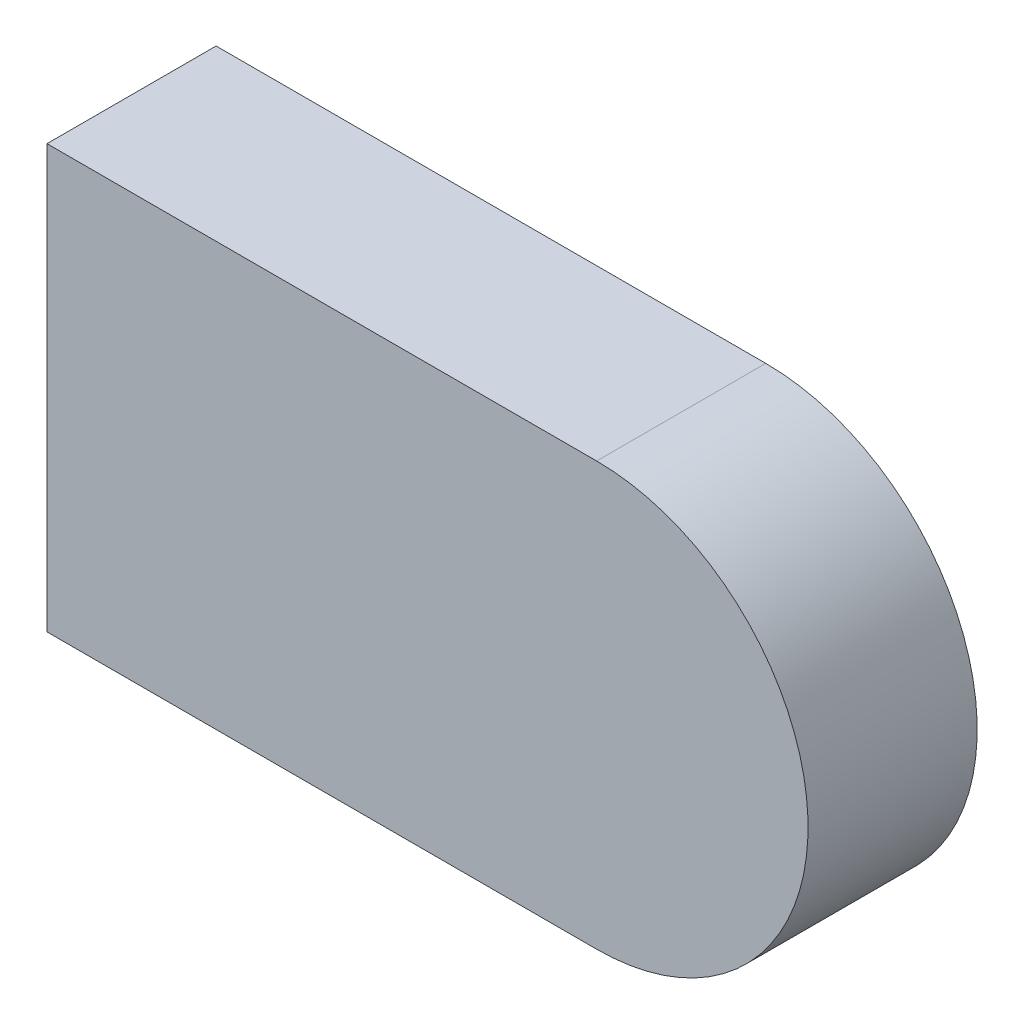
ISO-10303-21;
HEADER;
FILE_DESCRIPTION(('STEP AP214'),'2;1');
FILE_NAME('part.step','',(''),(''),'','','');
FILE_SCHEMA(('AUTOMOTIVE_DESIGN { 1 0 10303 214 1 1 1 1 }'));
ENDSEC;
DATA;
#1=APPLICATION_CONTEXT('core data for automotive mechanical design processes');
#2=APPLICATION_PROTOCOL_DEFINITION('international standard','automotive_design',2000,#1);
#3=PRODUCT_CONTEXT('',#1,'mechanical');
#4=PRODUCT('Part','Part','',(#3));
#5=PRODUCT_RELATED_PRODUCT_CATEGORY('part','',(#4));
#6=PRODUCT_DEFINITION_FORMATION('','',#4);
#7=PRODUCT_DEFINITION_CONTEXT('part definition',#1,'design');
#8=PRODUCT_DEFINITION('design','',#6,#7);
#9=PRODUCT_DEFINITION_SHAPE('','',#8);
#10=(LENGTH_UNIT() NAMED_UNIT(*) SI_UNIT(.MILLI.,.METRE.));
#11=(NAMED_UNIT(*) PLANE_ANGLE_UNIT() SI_UNIT($,.RADIAN.));
#12=(NAMED_UNIT(*) SI_UNIT($,.STERADIAN.) SOLID_ANGLE_UNIT());
#13=UNCERTAINTY_MEASURE_WITH_UNIT(LENGTH_MEASURE(1.E-05),#10,'distance_accuracy_value','');
#14=(GEOMETRIC_REPRESENTATION_CONTEXT(3) GLOBAL_UNCERTAINTY_ASSIGNED_CONTEXT((#13)) GLOBAL_UNIT_ASSIGNED_CONTEXT((#10,
#11,#12)) REPRESENTATION_CONTEXT('',''));
#15=CARTESIAN_POINT('',(0.,0.,0.));
#16=DIRECTION('',(0.,0.,1.));
#17=DIRECTION('',(1.,0.,0.));
#18=AXIS2_PLACEMENT_3D('',#15,#16,#17);
#19=CARTESIAN_POINT('',(-2.05,1.125,0.));
#20=DIRECTION('',(0.,1.,0.));
#21=DIRECTION('',(1.,0.,0.));
#22=AXIS2_PLACEMENT_3D('',#19,#20,#21);
#23=PLANE('',#22);
#24=DIRECTION('',(1.,0.,0.));
#25=VECTOR('',#24,1.);
#26=CARTESIAN_POINT('',(-2.05,1.125,0.));
#27=LINE('',#26,#25);
#28=CARTESIAN_POINT('',(-2.05,1.125,0.));
#29=VERTEX_POINT('',#28);
#30=CARTESIAN_POINT('',(-1.725,1.125,0.));
#31=VERTEX_POINT('',#30);
#32=EDGE_CURVE('E11',#29,#31,#27,.T.);
#33=ORIENTED_EDGE('',*,*,#32,.T.);
#34=DIRECTION('',(0.,0.,1.));
#35=VECTOR('',#34,1.);
#36=CARTESIAN_POINT('',(-1.725,1.125,0.));
#37=LINE('',#36,#35);
#38=CARTESIAN_POINT('',(-1.725,1.125,0.1));
#39=VERTEX_POINT('',#38);
#40=EDGE_CURVE('E24',#31,#39,#37,.T.);
#41=ORIENTED_EDGE('',*,*,#40,.T.);
#42=DIRECTION('',(1.,0.,0.));
#43=VECTOR('',#42,1.);
#44=CARTESIAN_POINT('',(-2.05,1.125,0.1));
#45=LINE('',#44,#43);
#46=CARTESIAN_POINT('',(-2.05,1.125,0.1));
#47=VERTEX_POINT('',#46);
#48=EDGE_CURVE('E88',#47,#39,#45,.T.);
#49=ORIENTED_EDGE('',*,*,#48,.F.);
#50=DIRECTION('',(0.,0.,1.));
#51=VECTOR('',#50,1.);
#52=CARTESIAN_POINT('',(-2.05,1.125,0.));
#53=LINE('',#52,#51);
#54=EDGE_CURVE('E36',#29,#47,#53,.T.);
#55=ORIENTED_EDGE('',*,*,#54,.F.);
#56=EDGE_LOOP('',(#33,#41,#49,#55));
#57=FACE_BOUND('',#56,.T.);
#58=ADVANCED_FACE('F17',(#57),#23,.F.);
#59=CARTESIAN_POINT('',(-1.725,1.25,0.));
#60=DIRECTION('',(0.,0.,-1.));
#61=DIRECTION('',(1.,0.,0.));
#62=AXIS2_PLACEMENT_3D('',#59,#60,#61);
#63=CYLINDRICAL_SURFACE('',#62,0.125);
#64=CARTESIAN_POINT('',(-1.725,1.25,0.));
#65=DIRECTION('',(0.,0.,1.));
#66=DIRECTION('',(1.,0.,0.));
#67=AXIS2_PLACEMENT_3D('',#64,#65,#66);
#68=CIRCLE('',#67,0.125);
#69=CARTESIAN_POINT('',(-1.725,1.375,0.));
#70=VERTEX_POINT('',#69);
#71=EDGE_CURVE('E85',#31,#70,#68,.T.);
#72=ORIENTED_EDGE('',*,*,#71,.T.);
#73=DIRECTION('',(0.,0.,1.));
#74=VECTOR('',#73,1.);
#75=CARTESIAN_POINT('',(-1.725,1.375,0.));
#76=LINE('',#75,#74);
#77=CARTESIAN_POINT('',(-1.725,1.375,0.1));
#78=VERTEX_POINT('',#77);
#79=EDGE_CURVE('E73',#70,#78,#76,.T.);
#80=ORIENTED_EDGE('',*,*,#79,.T.);
#81=CARTESIAN_POINT('',(-1.725,1.25,0.1));
#82=DIRECTION('',(0.,0.,1.));
#83=DIRECTION('',(1.,0.,0.));
#84=AXIS2_PLACEMENT_3D('',#81,#82,#83);
#85=CIRCLE('',#84,0.125);
#86=EDGE_CURVE('E66',#39,#78,#85,.T.);
#87=ORIENTED_EDGE('',*,*,#86,.F.);
#88=ORIENTED_EDGE('',*,*,#40,.F.);
#89=EDGE_LOOP('',(#72,#80,#87,#88));
#90=FACE_BOUND('',#89,.T.);
#91=ADVANCED_FACE('F89',(#90),#63,.T.);
#92=CARTESIAN_POINT('',(-2.05,1.375,0.));
#93=DIRECTION('',(0.,1.,0.));
#94=DIRECTION('',(1.,0.,0.));
#95=AXIS2_PLACEMENT_3D('',#92,#93,#94);
#96=PLANE('',#95);
#97=DIRECTION('',(0.,0.,1.));
#98=VECTOR('',#97,1.);
#99=CARTESIAN_POINT('',(-2.05,1.375,0.));
#100=LINE('',#99,#98);
#101=CARTESIAN_POINT('',(-2.05,1.375,0.));
#102=VERTEX_POINT('',#101);
#103=CARTESIAN_POINT('',(-2.05,1.375,0.1));
#104=VERTEX_POINT('',#103);
#105=EDGE_CURVE('E56',#102,#104,#100,.T.);
#106=ORIENTED_EDGE('',*,*,#105,.T.);
#107=DIRECTION('',(1.,0.,0.));
#108=VECTOR('',#107,1.);
#109=CARTESIAN_POINT('',(-2.05,1.375,0.1));
#110=LINE('',#109,#108);
#111=EDGE_CURVE('E67',#104,#78,#110,.T.);
#112=ORIENTED_EDGE('',*,*,#111,.T.);
#113=ORIENTED_EDGE('',*,*,#79,.F.);
#114=DIRECTION('',(1.,0.,0.));
#115=VECTOR('',#114,1.);
#116=CARTESIAN_POINT('',(-2.05,1.375,0.));
#117=LINE('',#116,#115);
#118=EDGE_CURVE('E71',#102,#70,#117,.T.);
#119=ORIENTED_EDGE('',*,*,#118,.F.);
#120=EDGE_LOOP('',(#106,#112,#113,#119));
#121=FACE_BOUND('',#120,.T.);
#122=ADVANCED_FACE('F72',(#121),#96,.T.);
#123=CARTESIAN_POINT('',(-2.05,1.125,0.));
#124=DIRECTION('',(-1.,0.,0.));
#125=DIRECTION('',(0.,1.,0.));
#126=AXIS2_PLACEMENT_3D('',#123,#124,#125);
#127=PLANE('',#126);
#128=ORIENTED_EDGE('',*,*,#54,.T.);
#129=DIRECTION('',(0.,1.,0.));
#130=VECTOR('',#129,1.);
#131=CARTESIAN_POINT('',(-2.05,1.125,0.1));
#132=LINE('',#131,#130);
#133=EDGE_CURVE('E62',#47,#104,#132,.T.);
#134=ORIENTED_EDGE('',*,*,#133,.T.);
#135=ORIENTED_EDGE('',*,*,#105,.F.);
#136=DIRECTION('',(0.,1.,0.));
#137=VECTOR('',#136,1.);
#138=CARTESIAN_POINT('',(-2.05,1.125,0.));
#139=LINE('',#138,#137);
#140=EDGE_CURVE('E60',#29,#102,#139,.T.);
#141=ORIENTED_EDGE('',*,*,#140,.F.);
#142=EDGE_LOOP('',(#128,#134,#135,#141));
#143=FACE_BOUND('',#142,.T.);
#144=ADVANCED_FACE('F58',(#143),#127,.T.);
#145=CARTESIAN_POINT('',(-1.850342514613,1.25,0.));
#146=DIRECTION('',(0.,0.,1.));
#147=DIRECTION('',(1.,0.,0.));
#148=AXIS2_PLACEMENT_3D('',#145,#146,#147);
#149=PLANE('',#148);
#150=ORIENTED_EDGE('',*,*,#140,.T.);
#151=ORIENTED_EDGE('',*,*,#118,.T.);
#152=ORIENTED_EDGE('',*,*,#71,.F.);
#153=ORIENTED_EDGE('',*,*,#32,.F.);
#154=EDGE_LOOP('',(#150,#151,#152,#153));
#155=FACE_BOUND('',#154,.T.);
#156=ADVANCED_FACE('F77',(#155),#149,.F.);
#157=CARTESIAN_POINT('',(-1.850342514613,1.25,0.1));
#158=DIRECTION('',(0.,0.,1.));
#159=DIRECTION('',(1.,0.,0.));
#160=AXIS2_PLACEMENT_3D('',#157,#158,#159);
#161=PLANE('',#160);
#162=ORIENTED_EDGE('',*,*,#48,.T.);
#163=ORIENTED_EDGE('',*,*,#86,.T.);
#164=ORIENTED_EDGE('',*,*,#111,.F.);
#165=ORIENTED_EDGE('',*,*,#133,.F.);
#166=EDGE_LOOP('',(#162,#163,#164,#165));
#167=FACE_BOUND('',#166,.T.);
#168=ADVANCED_FACE('F91',(#167),#161,.T.);
#169=CLOSED_SHELL('',(#58,#91,#122,#144,#156,#168));
#170=MANIFOLD_SOLID_BREP('B1',#169);
#171=ADVANCED_BREP_SHAPE_REPRESENTATION('',(#18,#170),#14);
#172=SHAPE_DEFINITION_REPRESENTATION(#9,#171);
ENDSEC;
END-ISO-10303-21;
